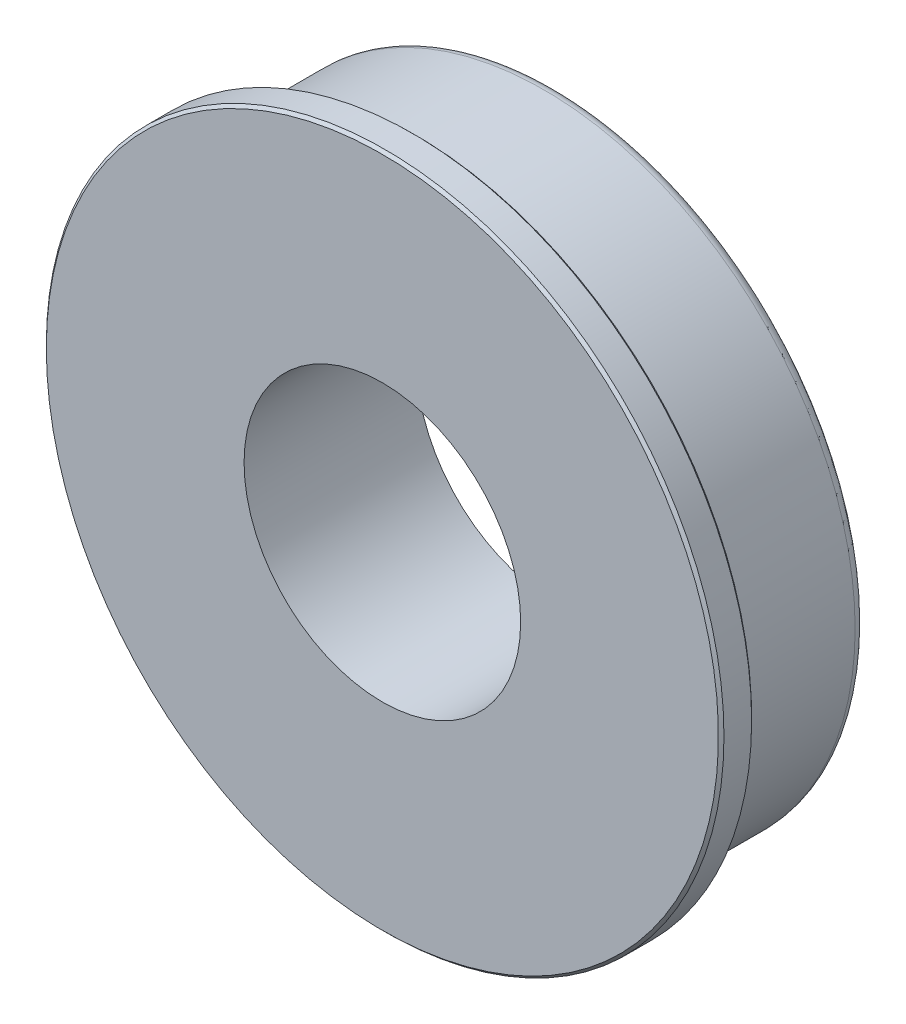
ISO-10303-21;
HEADER;
FILE_DESCRIPTION(('STEP AP214'),'2;1');
FILE_NAME('part.step','',(''),(''),'','','');
FILE_SCHEMA(('AUTOMOTIVE_DESIGN { 1 0 10303 214 1 1 1 1 }'));
ENDSEC;
DATA;
#1=APPLICATION_CONTEXT('core data for automotive mechanical design processes');
#2=APPLICATION_PROTOCOL_DEFINITION('international standard','automotive_design',2000,#1);
#3=PRODUCT_CONTEXT('',#1,'mechanical');
#4=PRODUCT('Part','Part','',(#3));
#5=PRODUCT_RELATED_PRODUCT_CATEGORY('part','',(#4));
#6=PRODUCT_DEFINITION_FORMATION('','',#4);
#7=PRODUCT_DEFINITION_CONTEXT('part definition',#1,'design');
#8=PRODUCT_DEFINITION('design','',#6,#7);
#9=PRODUCT_DEFINITION_SHAPE('','',#8);
#10=(LENGTH_UNIT() NAMED_UNIT(*) SI_UNIT(.MILLI.,.METRE.));
#11=(NAMED_UNIT(*) PLANE_ANGLE_UNIT() SI_UNIT($,.RADIAN.));
#12=(NAMED_UNIT(*) SI_UNIT($,.STERADIAN.) SOLID_ANGLE_UNIT());
#13=UNCERTAINTY_MEASURE_WITH_UNIT(LENGTH_MEASURE(1.E-05),#10,'distance_accuracy_value','');
#14=(GEOMETRIC_REPRESENTATION_CONTEXT(3) GLOBAL_UNCERTAINTY_ASSIGNED_CONTEXT((#13)) GLOBAL_UNIT_ASSIGNED_CONTEXT((#10,
#11,#12)) REPRESENTATION_CONTEXT('',''));
#15=CARTESIAN_POINT('',(0.,0.,0.));
#16=DIRECTION('',(0.,0.,1.));
#17=DIRECTION('',(1.,0.,0.));
#18=AXIS2_PLACEMENT_3D('',#15,#16,#17);
#19=CARTESIAN_POINT('',(-1.04083408558608E-13,47.3069264516129,5.89533999999997));
#20=DIRECTION('',(0.,0.,-1.));
#21=DIRECTION('',(-1.,0.,0.));
#22=AXIS2_PLACEMENT_3D('',#19,#20,#21);
#23=PLANE('',#22);
#24=CARTESIAN_POINT('',(0.,0.,5.89534000000008));
#25=DIRECTION('',(0.,0.,1.));
#26=DIRECTION('',(1.,0.,0.));
#27=AXIS2_PLACEMENT_3D('',#24,#25,#26);
#28=CIRCLE('',#27,14.2875);
#29=CARTESIAN_POINT('',(14.2875,0.,5.89534000000009));
#30=VERTEX_POINT('',#29);
#31=EDGE_CURVE('E45',#30,#30,#28,.F.);
#32=ORIENTED_EDGE('',*,*,#31,.F.);
#33=EDGE_LOOP('',(#32));
#34=FACE_BOUND('',#33,.T.);
#35=CARTESIAN_POINT('',(0.,0.,5.89534000000008));
#36=DIRECTION('',(0.,0.,-1.));
#37=DIRECTION('',(-1.,0.,0.));
#38=AXIS2_PLACEMENT_3D('',#35,#36,#37);
#39=CIRCLE('',#38,13.97);
#40=CARTESIAN_POINT('',(-13.97,0.,5.89534000000008));
#41=VERTEX_POINT('',#40);
#42=EDGE_CURVE('E18',#41,#41,#39,.F.);
#43=ORIENTED_EDGE('',*,*,#42,.F.);
#44=EDGE_LOOP('',(#43));
#45=FACE_BOUND('',#44,.T.);
#46=ADVANCED_FACE('F14',(#34,#45),#23,.F.);
#47=CARTESIAN_POINT('',(-1.6306400674182E-13,0.,-57.0071249999995));
#48=DIRECTION('',(0.,0.,-1.));
#49=DIRECTION('',(-1.,0.,0.));
#50=AXIS2_PLACEMENT_3D('',#47,#48,#49);
#51=CYLINDRICAL_SURFACE('',#50,13.97);
#52=ORIENTED_EDGE('',*,*,#42,.T.);
#53=EDGE_LOOP('',(#52));
#54=FACE_BOUND('',#53,.T.);
#55=CARTESIAN_POINT('',(0.,1.11022302462516E-13,6.40333999999992));
#56=DIRECTION('',(0.,0.,-1.));
#57=DIRECTION('',(-1.,0.,0.));
#58=AXIS2_PLACEMENT_3D('',#55,#56,#57);
#59=CIRCLE('',#58,13.97);
#60=CARTESIAN_POINT('',(-13.97,1.11603920549541E-13,6.40333999999992));
#61=VERTEX_POINT('',#60);
#62=EDGE_CURVE('E43',#61,#61,#59,.F.);
#63=ORIENTED_EDGE('',*,*,#62,.F.);
#64=EDGE_LOOP('',(#63));
#65=FACE_BOUND('',#64,.T.);
#66=ADVANCED_FACE('F52',(#54,#65),#51,.T.);
#67=CARTESIAN_POINT('',(0.,0.,6.40334000000042));
#68=DIRECTION('',(0.,0.,1.));
#69=DIRECTION('',(1.,0.,0.));
#70=AXIS2_PLACEMENT_3D('',#67,#68,#69);
#71=CYLINDRICAL_SURFACE('',#70,14.2875);
#72=CARTESIAN_POINT('',(0.,0.,0.507999999999842));
#73=DIRECTION('',(0.,0.,-1.));
#74=DIRECTION('',(-1.,0.,0.));
#75=AXIS2_PLACEMENT_3D('',#72,#73,#74);
#76=CIRCLE('',#75,14.2875);
#77=CARTESIAN_POINT('',(-14.2875,0.,0.507999999999834));
#78=VERTEX_POINT('',#77);
#79=EDGE_CURVE('E30',#78,#78,#76,.T.);
#80=ORIENTED_EDGE('',*,*,#79,.F.);
#81=EDGE_LOOP('',(#80));
#82=FACE_BOUND('',#81,.T.);
#83=ORIENTED_EDGE('',*,*,#31,.T.);
#84=EDGE_LOOP('',(#83));
#85=FACE_BOUND('',#84,.T.);
#86=ADVANCED_FACE('F61',(#82,#85),#71,.T.);
#87=CARTESIAN_POINT('',(0.,0.,6.40334000000042));
#88=DIRECTION('',(0.,0.,-1.));
#89=DIRECTION('',(-1.,0.,0.));
#90=AXIS2_PLACEMENT_3D('',#87,#88,#89);
#91=PLANE('',#90);
#92=CARTESIAN_POINT('',(0.,0.,6.40334000000042));
#93=DIRECTION('',(0.,0.,1.));
#94=DIRECTION('',(0.,-0.999999999999999,0.));
#95=AXIS2_PLACEMENT_3D('',#92,#93,#94);
#96=CIRCLE('',#95,15.4305);
#97=CARTESIAN_POINT('',(0.,-15.4305000000001,6.40334000000042));
#98=VERTEX_POINT('',#97);
#99=EDGE_CURVE('E40',#98,#98,#96,.T.);
#100=ORIENTED_EDGE('',*,*,#99,.F.);
#101=EDGE_LOOP('',(#100));
#102=FACE_BOUND('',#101,.T.);
#103=ORIENTED_EDGE('',*,*,#62,.T.);
#104=EDGE_LOOP('',(#103));
#105=FACE_BOUND('',#104,.T.);
#106=ADVANCED_FACE('F91',(#102,#105),#91,.T.);
#107=CARTESIAN_POINT('',(0.,0.,0.507999999999842));
#108=DIRECTION('',(0.,0.,-1.));
#109=DIRECTION('',(-1.,0.,0.));
#110=AXIS2_PLACEMENT_3D('',#107,#108,#109);
#111=TOROIDAL_SURFACE('',#110,13.7795,0.508000000000003);
#112=ORIENTED_EDGE('',*,*,#79,.T.);
#113=EDGE_LOOP('',(#112));
#114=FACE_BOUND('',#113,.T.);
#115=CARTESIAN_POINT('',(0.,0.,0.));
#116=DIRECTION('',(0.,0.,-1.));
#117=DIRECTION('',(-1.,0.,0.));
#118=AXIS2_PLACEMENT_3D('',#115,#116,#117);
#119=CIRCLE('',#118,13.7795);
#120=CARTESIAN_POINT('',(-13.7795,0.,0.));
#121=VERTEX_POINT('',#120);
#122=EDGE_CURVE('E37',#121,#121,#119,.T.);
#123=ORIENTED_EDGE('',*,*,#122,.F.);
#124=EDGE_LOOP('',(#123));
#125=FACE_BOUND('',#124,.T.);
#126=ADVANCED_FACE('F16',(#114,#125),#111,.T.);
#127=CARTESIAN_POINT('',(0.,1.2490009027033E-13,6.53033999999986));
#128=DIRECTION('',(0.,0.,1.));
#129=DIRECTION('',(0.,-0.999999999999999,0.));
#130=AXIS2_PLACEMENT_3D('',#127,#128,#129);
#131=CONICAL_SURFACE('',#130,15.5575000000007,0.785398163400003);
#132=CARTESIAN_POINT('',(0.,1.2490009027033E-13,6.53033999999986));
#133=DIRECTION('',(0.,0.,1.));
#134=DIRECTION('',(1.,0.,0.));
#135=AXIS2_PLACEMENT_3D('',#132,#133,#134);
#136=CIRCLE('',#135,15.5575);
#137=CARTESIAN_POINT('',(15.5574999999999,1.2425237921887E-13,6.53033999999986));
#138=VERTEX_POINT('',#137);
#139=EDGE_CURVE('E36',#138,#138,#136,.T.);
#140=ORIENTED_EDGE('',*,*,#139,.F.);
#141=EDGE_LOOP('',(#140));
#142=FACE_BOUND('',#141,.T.);
#143=ORIENTED_EDGE('',*,*,#99,.T.);
#144=EDGE_LOOP('',(#143));
#145=FACE_BOUND('',#144,.T.);
#146=ADVANCED_FACE('F86',(#142,#145),#131,.T.);
#147=CARTESIAN_POINT('',(0.,0.,0.));
#148=DIRECTION('',(0.,0.,-1.));
#149=DIRECTION('',(-1.,0.,0.));
#150=AXIS2_PLACEMENT_3D('',#147,#148,#149);
#151=PLANE('',#150);
#152=ORIENTED_EDGE('',*,*,#122,.T.);
#153=EDGE_LOOP('',(#152));
#154=FACE_BOUND('',#153,.T.);
#155=CARTESIAN_POINT('',(0.,0.,0.));
#156=DIRECTION('',(0.,0.,-1.));
#157=DIRECTION('',(-1.,0.,0.));
#158=AXIS2_PLACEMENT_3D('',#155,#156,#157);
#159=CIRCLE('',#158,6.35);
#160=CARTESIAN_POINT('',(-6.35,0.,0.));
#161=VERTEX_POINT('',#160);
#162=EDGE_CURVE('E33',#161,#161,#159,.F.);
#163=ORIENTED_EDGE('',*,*,#162,.T.);
#164=EDGE_LOOP('',(#163));
#165=FACE_BOUND('',#164,.T.);
#166=ADVANCED_FACE('F82',(#154,#165),#151,.T.);
#167=CARTESIAN_POINT('',(0.,1.11022302462516E-13,7.92733999999989));
#168=DIRECTION('',(0.,0.,1.));
#169=DIRECTION('',(1.,0.,0.));
#170=AXIS2_PLACEMENT_3D('',#167,#168,#169);
#171=CYLINDRICAL_SURFACE('',#170,15.5575);
#172=CARTESIAN_POINT('',(0.,0.,7.80034000000029));
#173=DIRECTION('',(0.,0.,-1.));
#174=DIRECTION('',(-1.,0.,0.));
#175=AXIS2_PLACEMENT_3D('',#172,#173,#174);
#176=CIRCLE('',#175,15.5575);
#177=CARTESIAN_POINT('',(-15.5575,0.,7.80034000000029));
#178=VERTEX_POINT('',#177);
#179=EDGE_CURVE('E27',#178,#178,#176,.F.);
#180=ORIENTED_EDGE('',*,*,#179,.F.);
#181=EDGE_LOOP('',(#180));
#182=FACE_BOUND('',#181,.T.);
#183=ORIENTED_EDGE('',*,*,#139,.T.);
#184=EDGE_LOOP('',(#183));
#185=FACE_BOUND('',#184,.T.);
#186=ADVANCED_FACE('F78',(#182,#185),#171,.T.);
#187=CARTESIAN_POINT('',(0.,1.11022302462516E-13,7.92733999999989));
#188=DIRECTION('',(0.,0.,-1.));
#189=DIRECTION('',(-1.,0.,0.));
#190=AXIS2_PLACEMENT_3D('',#187,#188,#189);
#191=CYLINDRICAL_SURFACE('',#190,6.35);
#192=ORIENTED_EDGE('',*,*,#162,.F.);
#193=EDGE_LOOP('',(#192));
#194=FACE_BOUND('',#193,.T.);
#195=CARTESIAN_POINT('',(0.,1.11022302462516E-13,7.92733999999989));
#196=DIRECTION('',(0.,0.,-1.));
#197=DIRECTION('',(-1.,0.,0.));
#198=AXIS2_PLACEMENT_3D('',#195,#196,#197);
#199=CIRCLE('',#198,6.35);
#200=CARTESIAN_POINT('',(-6.35000000000002,1.11286674320255E-13,7.92733999999989));
#201=VERTEX_POINT('',#200);
#202=EDGE_CURVE('E22',#201,#201,#199,.F.);
#203=ORIENTED_EDGE('',*,*,#202,.T.);
#204=EDGE_LOOP('',(#203));
#205=FACE_BOUND('',#204,.T.);
#206=ADVANCED_FACE('F71',(#194,#205),#191,.F.);
#207=CARTESIAN_POINT('',(0.,0.,7.80034000000029));
#208=DIRECTION('',(0.,0.,-1.));
#209=DIRECTION('',(-1.,0.,0.));
#210=AXIS2_PLACEMENT_3D('',#207,#208,#209);
#211=CONICAL_SURFACE('',#210,15.5575,0.785398163400003);
#212=ORIENTED_EDGE('',*,*,#179,.T.);
#213=EDGE_LOOP('',(#212));
#214=FACE_BOUND('',#213,.T.);
#215=CARTESIAN_POINT('',(0.,1.11022302462516E-13,7.92733999999978));
#216=DIRECTION('',(0.,0.,-1.));
#217=DIRECTION('',(-1.,0.,0.));
#218=AXIS2_PLACEMENT_3D('',#215,#216,#217);
#219=CIRCLE('',#218,15.4304999999997);
#220=CARTESIAN_POINT('',(-15.4304999999997,1.11664726076821E-13,7.92733999999977));
#221=VERTEX_POINT('',#220);
#222=EDGE_CURVE('E10',#221,#221,#219,.T.);
#223=ORIENTED_EDGE('',*,*,#222,.T.);
#224=EDGE_LOOP('',(#223));
#225=FACE_BOUND('',#224,.T.);
#226=ADVANCED_FACE('F65',(#214,#225),#211,.T.);
#227=CARTESIAN_POINT('',(0.,1.11022302462516E-13,7.92733999999989));
#228=DIRECTION('',(0.,0.,-1.));
#229=DIRECTION('',(-1.,0.,0.));
#230=AXIS2_PLACEMENT_3D('',#227,#228,#229);
#231=PLANE('',#230);
#232=ORIENTED_EDGE('',*,*,#222,.F.);
#233=EDGE_LOOP('',(#232));
#234=FACE_BOUND('',#233,.T.);
#235=ORIENTED_EDGE('',*,*,#202,.F.);
#236=EDGE_LOOP('',(#235));
#237=FACE_BOUND('',#236,.T.);
#238=ADVANCED_FACE('F63',(#234,#237),#231,.F.);
#239=CLOSED_SHELL('',(#46,#66,#86,#106,#126,#146,#166,#186,#206,#226,#238));
#240=MANIFOLD_SOLID_BREP('B1',#239);
#241=ADVANCED_BREP_SHAPE_REPRESENTATION('',(#18,#240),#14);
#242=SHAPE_DEFINITION_REPRESENTATION(#9,#241);
ENDSEC;
END-ISO-10303-21;
